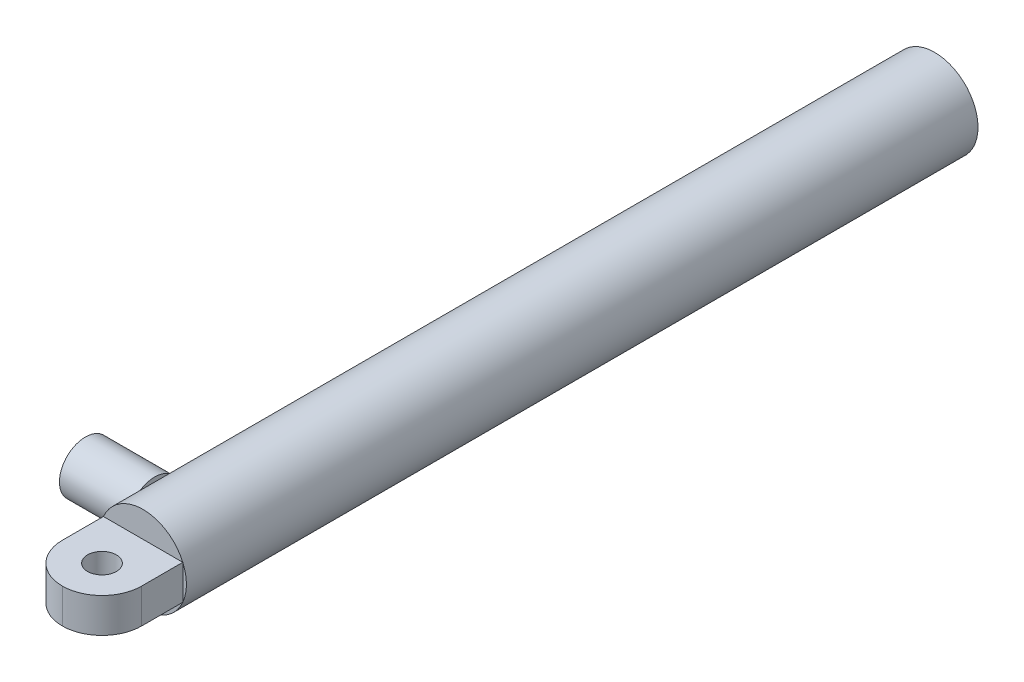
ISO-10303-21;
HEADER;
FILE_DESCRIPTION(('STEP AP214'),'2;1');
FILE_NAME('part.step','',(''),(''),'','','');
FILE_SCHEMA(('AUTOMOTIVE_DESIGN { 1 0 10303 214 1 1 1 1 }'));
ENDSEC;
DATA;
#1=APPLICATION_CONTEXT('core data for automotive mechanical design processes');
#2=APPLICATION_PROTOCOL_DEFINITION('international standard','automotive_design',2000,#1);
#3=PRODUCT_CONTEXT('',#1,'mechanical');
#4=PRODUCT('Part','Part','',(#3));
#5=PRODUCT_RELATED_PRODUCT_CATEGORY('part','',(#4));
#6=PRODUCT_DEFINITION_FORMATION('','',#4);
#7=PRODUCT_DEFINITION_CONTEXT('part definition',#1,'design');
#8=PRODUCT_DEFINITION('design','',#6,#7);
#9=PRODUCT_DEFINITION_SHAPE('','',#8);
#10=(LENGTH_UNIT() NAMED_UNIT(*) SI_UNIT(.MILLI.,.METRE.));
#11=(NAMED_UNIT(*) PLANE_ANGLE_UNIT() SI_UNIT($,.RADIAN.));
#12=(NAMED_UNIT(*) SI_UNIT($,.STERADIAN.) SOLID_ANGLE_UNIT());
#13=UNCERTAINTY_MEASURE_WITH_UNIT(LENGTH_MEASURE(1.E-05),#10,'distance_accuracy_value','');
#14=(GEOMETRIC_REPRESENTATION_CONTEXT(3) GLOBAL_UNCERTAINTY_ASSIGNED_CONTEXT((#13)) GLOBAL_UNIT_ASSIGNED_CONTEXT((#10,
#11,#12)) REPRESENTATION_CONTEXT('',''));
#15=CARTESIAN_POINT('',(0.,0.,0.));
#16=DIRECTION('',(0.,0.,1.));
#17=DIRECTION('',(1.,0.,0.));
#18=AXIS2_PLACEMENT_3D('',#15,#16,#17);
#19=CARTESIAN_POINT('',(0.,0.,664.));
#20=DIRECTION('',(0.,0.,-1.));
#21=DIRECTION('',(-1.,0.,0.));
#22=AXIS2_PLACEMENT_3D('',#19,#20,#21);
#23=CYLINDRICAL_SURFACE('',#22,37.5);
#24=CARTESIAN_POINT('',(0.,0.,686.));
#25=DIRECTION('',(0.,0.,1.));
#26=DIRECTION('',(1.,0.,0.));
#27=AXIS2_PLACEMENT_3D('',#24,#25,#26);
#28=CIRCLE('',#27,37.5);
#29=CARTESIAN_POINT('',(-34.3693177121688,-15.,686.));
#30=VERTEX_POINT('',#29);
#31=CARTESIAN_POINT('',(34.3693177121688,-15.,686.));
#32=VERTEX_POINT('',#31);
#33=EDGE_CURVE('E145',#30,#32,#28,.T.);
#34=ORIENTED_EDGE('',*,*,#33,.F.);
#35=CARTESIAN_POINT('',(-34.3693177121688,15.,686.));
#36=VERTEX_POINT('',#35);
#37=EDGE_CURVE('E144',#36,#30,#28,.T.);
#38=ORIENTED_EDGE('',*,*,#37,.F.);
#39=CARTESIAN_POINT('',(34.3693177121688,15.,686.));
#40=VERTEX_POINT('',#39);
#41=EDGE_CURVE('E269',#40,#36,#28,.T.);
#42=ORIENTED_EDGE('',*,*,#41,.F.);
#43=EDGE_CURVE('E149',#32,#40,#28,.T.);
#44=ORIENTED_EDGE('',*,*,#43,.F.);
#45=EDGE_LOOP('',(#34,#38,#42,#44));
#46=FACE_BOUND('',#45,.T.);
#47=CARTESIAN_POINT('',(0.,0.,0.));
#48=DIRECTION('',(0.,0.,1.));
#49=DIRECTION('',(1.,0.,0.));
#50=AXIS2_PLACEMENT_3D('',#47,#48,#49);
#51=CIRCLE('',#50,37.5);
#52=CARTESIAN_POINT('',(37.5,0.,0.));
#53=VERTEX_POINT('',#52);
#54=EDGE_CURVE('E155',#53,#53,#51,.T.);
#55=ORIENTED_EDGE('',*,*,#54,.T.);
#56=EDGE_LOOP('',(#55));
#57=FACE_BOUND('',#56,.T.);
#58=DIRECTION('',(0.,0.,-1.));
#59=VECTOR('',#58,1.);
#60=CARTESIAN_POINT('',(-34.3693177121688,15.,664.));
#61=LINE('',#60,#59);
#62=CARTESIAN_POINT('',(-34.3693177121688,15.,658.410509831249));
#63=VERTEX_POINT('',#62);
#64=CARTESIAN_POINT('',(-34.3693177121688,15.,624.869490168752));
#65=VERTEX_POINT('',#64);
#66=EDGE_CURVE('E11',#63,#65,#61,.T.);
#67=ORIENTED_EDGE('',*,*,#66,.F.);
#68=CARTESIAN_POINT('',(-34.3693177121688,-15.,658.410509831249));
#69=CARTESIAN_POINT('',(-34.5628287516957,-14.5567209000954,658.806987511772));
#70=CARTESIAN_POINT('',(-34.753259124379,-14.0968897878321,659.186638319474));
#71=CARTESIAN_POINT('',(-35.1240963346518,-13.1456356652409,659.910184644091));
#72=CARTESIAN_POINT('',(-35.3044968691848,-12.6541931985463,660.254057792895));
#73=CARTESIAN_POINT('',(-35.6520956851179,-11.6390565503224,660.905198090059));
#74=CARTESIAN_POINT('',(-35.8192175962027,-11.1152028643747,661.212258023929));
#75=CARTESIAN_POINT('',(-36.1352949412633,-10.0401304004241,661.784890344045));
#76=CARTESIAN_POINT('',(-36.2842536964657,-9.48891665136525,662.050470317617));
#77=CARTESIAN_POINT('',(-36.5610162796752,-8.35951880238463,662.538528200853));
#78=CARTESIAN_POINT('',(-36.6887242850449,-7.78122684512794,662.760811608805));
#79=CARTESIAN_POINT('',(-36.9188537072728,-6.60364236172032,663.158085397292));
#80=CARTESIAN_POINT('',(-37.0212737634304,-6.004348707485,663.333073232983));
#81=CARTESIAN_POINT('',(-37.1977328325532,-4.79097726725823,663.632862034061));
#82=CARTESIAN_POINT('',(-37.2718484197819,-4.17694421585507,663.757798453));
#83=CARTESIAN_POINT('',(-37.3899269709226,-2.93777964019403,663.956205468356));
#84=CARTESIAN_POINT('',(-37.4338935988896,-2.3126494740643,664.029682318764));
#85=CARTESIAN_POINT('',(-37.4877111085339,-1.11614197554258,664.119537371973));
#86=CARTESIAN_POINT('',(-37.5003823623163,-0.545240418529896,664.14063692345));
#87=CARTESIAN_POINT('',(-37.4996001361523,0.5964774996861,664.139333907304));
#88=CARTESIAN_POINT('',(-37.4861482499842,1.16729386396215,664.116933993594));
#89=CARTESIAN_POINT('',(-37.4334488595239,2.30458877960859,664.028933110377));
#90=CARTESIAN_POINT('',(-37.3941914555128,2.87106558179513,663.963315561356));
#91=CARTESIAN_POINT('',(-37.290845191301,3.99517801020673,663.789762800002));
#92=CARTESIAN_POINT('',(-37.2267565774985,4.55281372410406,663.681828007579));
#93=CARTESIAN_POINT('',(-37.078549707373,5.63158725953805,663.430563717142));
#94=CARTESIAN_POINT('',(-36.9954114593022,6.15326331708579,663.288956171824));
#95=CARTESIAN_POINT('',(-36.8095586020448,7.18189300910043,662.969801438841));
#96=CARTESIAN_POINT('',(-36.7068439901398,7.68884664152293,662.792254246186));
#97=CARTESIAN_POINT('',(-36.4838288090728,8.68568893152007,662.402833548178));
#98=CARTESIAN_POINT('',(-36.3635195473292,9.17556900495527,662.190943069999));
#99=CARTESIAN_POINT('',(-36.1076806513707,10.13570080616,661.734780668778));
#100=CARTESIAN_POINT('',(-35.9721525172412,10.6059544621988,661.490511936751));
#101=CARTESIAN_POINT('',(-35.6105717431086,11.7766767549847,660.829221146969));
#102=CARTESIAN_POINT('',(-35.3755323812738,12.4624725279757,660.390755977586));
#103=CARTESIAN_POINT('',(-35.0076626368683,13.4475411338123,659.683743444026));
#104=CARTESIAN_POINT('',(-34.8826793662466,13.7681941230643,659.440241082942));
#105=CARTESIAN_POINT('',(-34.6287075029952,14.3950282693196,658.937236098358));
#106=CARTESIAN_POINT('',(-34.4997190122279,14.7012097938685,658.677733881606));
#107=CARTESIAN_POINT('',(-34.3693177121688,15.,658.410509831249));
#108=B_SPLINE_CURVE_WITH_KNOTS('',3,(#68,#69,#70,#71,#72,#73,#74,#75,#76,#77,#78,#79,#80,#81,
#82,#83,#84,#85,#86,#87,#88,#89,#90,#91,#92,#93,#94,#95,#96,#97,#98,#99,#100,#101,#102,#103,
#104,#105,#106,#107),.UNSPECIFIED.,.F.,.F.,(4,2,2,2,2,2,2,2,2,2,2,2,2,2,2,2,2,2,2,4),(0.,
1.87594742089729,3.75306071997183,5.64028783731769,7.52716934631218,9.42234113275378,
11.3176148728852,13.2077242336482,15.0976038454355,16.8096899193566,18.5216715418299,
20.2343103119635,21.9469320881554,23.5858954528663,25.2248590451667,26.8646351149657,
28.5042496978762,31.0401351017163,32.3044261667614,33.568685104123),.UNSPECIFIED.);
#109=CARTESIAN_POINT('',(-34.3693177121688,-15.,658.410509831249));
#110=VERTEX_POINT('',#109);
#111=EDGE_CURVE('E46',#110,#63,#108,.T.);
#112=ORIENTED_EDGE('',*,*,#111,.F.);
#113=DIRECTION('',(0.,0.,-1.));
#114=VECTOR('',#113,1.);
#115=CARTESIAN_POINT('',(-34.3693177121688,-15.,664.));
#116=LINE('',#115,#114);
#117=CARTESIAN_POINT('',(-34.3693177121688,-15.,624.869490168752));
#118=VERTEX_POINT('',#117);
#119=EDGE_CURVE('E97',#118,#110,#116,.F.);
#120=ORIENTED_EDGE('',*,*,#119,.F.);
#121=CARTESIAN_POINT('',(-34.3693177121688,15.,624.869490168752));
#122=CARTESIAN_POINT('',(-34.5628287516957,14.5567209000954,624.473012488228));
#123=CARTESIAN_POINT('',(-34.753259124379,14.0968897878321,624.093361680526));
#124=CARTESIAN_POINT('',(-35.1240963346518,13.1456356652409,623.369815355909));
#125=CARTESIAN_POINT('',(-35.3044968691848,12.6541931985463,623.025942207105));
#126=CARTESIAN_POINT('',(-35.6520956851179,11.6390565503224,622.374801909941));
#127=CARTESIAN_POINT('',(-35.8192175962027,11.1152028643747,622.067741976071));
#128=CARTESIAN_POINT('',(-36.1352949412633,10.0401304004241,621.495109655955));
#129=CARTESIAN_POINT('',(-36.2842536964657,9.48891665136525,621.229529682383));
#130=CARTESIAN_POINT('',(-36.5610162796752,8.35951880238463,620.741471799147));
#131=CARTESIAN_POINT('',(-36.6887242850449,7.78122684512794,620.519188391195));
#132=CARTESIAN_POINT('',(-36.9188537072728,6.60364236172032,620.121914602708));
#133=CARTESIAN_POINT('',(-37.0212737634304,6.004348707485,619.946926767017));
#134=CARTESIAN_POINT('',(-37.1977328325532,4.79097726725823,619.647137965939));
#135=CARTESIAN_POINT('',(-37.2718484197819,4.17694421585507,619.522201547));
#136=CARTESIAN_POINT('',(-37.3899269709226,2.93777964019403,619.323794531645));
#137=CARTESIAN_POINT('',(-37.4338935988896,2.3126494740643,619.250317681236));
#138=CARTESIAN_POINT('',(-37.4877111085339,1.11614197554259,619.160462628027));
#139=CARTESIAN_POINT('',(-37.5003823623163,0.5452404185299,619.13936307655));
#140=CARTESIAN_POINT('',(-37.4996001361523,-0.596477499686092,619.140666092696));
#141=CARTESIAN_POINT('',(-37.4861482499842,-1.16729386396215,619.163066006406));
#142=CARTESIAN_POINT('',(-37.4334488595239,-2.30458877960858,619.251066889624));
#143=CARTESIAN_POINT('',(-37.3941914555128,-2.87106558179512,619.316684438644));
#144=CARTESIAN_POINT('',(-37.2908451913011,-3.99517801020673,619.490237199998));
#145=CARTESIAN_POINT('',(-37.2267565774985,-4.55281372410406,619.598171992421));
#146=CARTESIAN_POINT('',(-37.078549707373,-5.63158725953805,619.849436282858));
#147=CARTESIAN_POINT('',(-36.9954114593022,-6.15326331708579,619.991043828176));
#148=CARTESIAN_POINT('',(-36.8095586020448,-7.18189300910043,620.310198561159));
#149=CARTESIAN_POINT('',(-36.7068439901398,-7.68884664152293,620.487745753814));
#150=CARTESIAN_POINT('',(-36.4838288090728,-8.68568893152007,620.877166451822));
#151=CARTESIAN_POINT('',(-36.3635195473291,-9.17556900495527,621.089056930001));
#152=CARTESIAN_POINT('',(-36.1076806513707,-10.13570080616,621.545219331222));
#153=CARTESIAN_POINT('',(-35.9721525172412,-10.6059544621988,621.789488063249));
#154=CARTESIAN_POINT('',(-35.6105717431086,-11.7766767549847,622.450778853032));
#155=CARTESIAN_POINT('',(-35.3755323812738,-12.4624725279757,622.889244022414));
#156=CARTESIAN_POINT('',(-35.0076626368683,-13.4475411338123,623.596256555975));
#157=CARTESIAN_POINT('',(-34.8826793662466,-13.7681941230643,623.839758917058));
#158=CARTESIAN_POINT('',(-34.6287075029952,-14.3950282693196,624.342763901643));
#159=CARTESIAN_POINT('',(-34.4997190122279,-14.7012097938685,624.602266118394));
#160=CARTESIAN_POINT('',(-34.3693177121688,-15.,624.869490168752));
#161=B_SPLINE_CURVE_WITH_KNOTS('',3,(#121,#122,#123,#124,#125,#126,#127,#128,#129,#130,#131,
#132,#133,#134,#135,#136,#137,#138,#139,#140,#141,#142,#143,#144,#145,#146,#147,#148,#149,#150,
#151,#152,#153,#154,#155,#156,#157,#158,#159,#160),.UNSPECIFIED.,.F.,.F.,(4,2,2,2,2,2,2,2,2,2,2,
2,2,2,2,2,2,2,2,4),(0.,1.87594742089729,3.75306071997183,5.64028783731769,7.52716934631218,
9.42234113275378,11.3176148728852,13.2077242336482,15.0976038454355,16.8096899193566,
18.5216715418299,20.2343103119635,21.9469320881554,23.5858954528663,25.2248590451667,
26.8646351149657,28.5042496978762,31.0401351017163,32.3044261667614,33.568685104123),.UNSPECIFIED.);
#162=EDGE_CURVE('E56',#65,#118,#161,.T.);
#163=ORIENTED_EDGE('',*,*,#162,.F.);
#164=EDGE_LOOP('',(#67,#112,#120,#163));
#165=FACE_BOUND('',#164,.T.);
#166=ADVANCED_FACE('F38',(#46,#57,#165),#23,.T.);
#167=CARTESIAN_POINT('',(0.,0.,686.));
#168=DIRECTION('',(0.,0.,1.));
#169=DIRECTION('',(1.,0.,0.));
#170=AXIS2_PLACEMENT_3D('',#167,#168,#169);
#171=PLANE('',#170);
#172=DIRECTION('',(0.,-1.,0.));
#173=VECTOR('',#172,1.);
#174=CARTESIAN_POINT('',(-34.3693177121688,-15.,686.));
#175=LINE('',#174,#173);
#176=EDGE_CURVE('E128',#36,#30,#175,.T.);
#177=ORIENTED_EDGE('',*,*,#176,.F.);
#178=ORIENTED_EDGE('',*,*,#37,.T.);
#179=EDGE_LOOP('',(#177,#178));
#180=FACE_BOUND('',#179,.T.);
#181=ADVANCED_FACE('F227',(#180),#171,.T.);
#182=ORIENTED_EDGE('',*,*,#43,.T.);
#183=DIRECTION('',(0.,1.,0.));
#184=VECTOR('',#183,1.);
#185=CARTESIAN_POINT('',(34.3693177121688,-15.,686.));
#186=LINE('',#185,#184);
#187=EDGE_CURVE('E133',#32,#40,#186,.T.);
#188=ORIENTED_EDGE('',*,*,#187,.F.);
#189=EDGE_LOOP('',(#182,#188));
#190=FACE_BOUND('',#189,.T.);
#191=ADVANCED_FACE('F241',(#190),#171,.T.);
#192=DIRECTION('',(1.,0.,0.));
#193=VECTOR('',#192,1.);
#194=CARTESIAN_POINT('',(-34.3693177121688,15.,686.));
#195=LINE('',#194,#193);
#196=EDGE_CURVE('E117',#36,#40,#195,.T.);
#197=ORIENTED_EDGE('',*,*,#196,.T.);
#198=ORIENTED_EDGE('',*,*,#41,.T.);
#199=EDGE_LOOP('',(#197,#198));
#200=FACE_BOUND('',#199,.T.);
#201=ADVANCED_FACE('F228',(#200),#171,.T.);
#202=CARTESIAN_POINT('',(0.,0.,0.));
#203=DIRECTION('',(0.,0.,1.));
#204=DIRECTION('',(1.,0.,0.));
#205=AXIS2_PLACEMENT_3D('',#202,#203,#204);
#206=PLANE('',#205);
#207=ORIENTED_EDGE('',*,*,#54,.F.);
#208=EDGE_LOOP('',(#207));
#209=FACE_BOUND('',#208,.T.);
#210=CARTESIAN_POINT('',(0.,0.,0.));
#211=DIRECTION('',(0.,0.,1.));
#212=DIRECTION('',(1.,0.,0.));
#213=AXIS2_PLACEMENT_3D('',#210,#211,#212);
#214=CIRCLE('',#213,17.5);
#215=CARTESIAN_POINT('',(17.5,0.,0.));
#216=VERTEX_POINT('',#215);
#217=EDGE_CURVE('E152',#216,#216,#214,.T.);
#218=ORIENTED_EDGE('',*,*,#217,.T.);
#219=EDGE_LOOP('',(#218));
#220=FACE_BOUND('',#219,.T.);
#221=ADVANCED_FACE('F234',(#209,#220),#206,.F.);
#222=CARTESIAN_POINT('',(0.,0.,664.));
#223=DIRECTION('',(0.,0.,-1.));
#224=DIRECTION('',(-1.,0.,0.));
#225=AXIS2_PLACEMENT_3D('',#222,#223,#224);
#226=CYLINDRICAL_SURFACE('',#225,17.5);
#227=CARTESIAN_POINT('',(0.,0.,664.));
#228=DIRECTION('',(0.,0.,1.));
#229=DIRECTION('',(1.,0.,0.));
#230=AXIS2_PLACEMENT_3D('',#227,#228,#229);
#231=CIRCLE('',#230,17.5);
#232=CARTESIAN_POINT('',(17.5,0.,664.));
#233=VERTEX_POINT('',#232);
#234=EDGE_CURVE('E148',#233,#233,#231,.T.);
#235=ORIENTED_EDGE('',*,*,#234,.T.);
#236=EDGE_LOOP('',(#235));
#237=FACE_BOUND('',#236,.T.);
#238=ORIENTED_EDGE('',*,*,#217,.F.);
#239=EDGE_LOOP('',(#238));
#240=FACE_BOUND('',#239,.T.);
#241=ADVANCED_FACE('F231',(#237,#240),#226,.F.);
#242=CARTESIAN_POINT('',(0.,0.,664.));
#243=DIRECTION('',(0.,0.,1.));
#244=DIRECTION('',(1.,0.,0.));
#245=AXIS2_PLACEMENT_3D('',#242,#243,#244);
#246=PLANE('',#245);
#247=ORIENTED_EDGE('',*,*,#234,.F.);
#248=EDGE_LOOP('',(#247));
#249=FACE_BOUND('',#248,.T.);
#250=ADVANCED_FACE('F225',(#249),#246,.F.);
#251=DIRECTION('',(1.,0.,0.));
#252=VECTOR('',#251,1.);
#253=CARTESIAN_POINT('',(-34.3693177121688,-15.,686.));
#254=LINE('',#253,#252);
#255=EDGE_CURVE('E136',#30,#32,#254,.T.);
#256=ORIENTED_EDGE('',*,*,#255,.F.);
#257=ORIENTED_EDGE('',*,*,#33,.T.);
#258=EDGE_LOOP('',(#256,#257));
#259=FACE_BOUND('',#258,.T.);
#260=ADVANCED_FACE('F221',(#259),#171,.T.);
#261=CARTESIAN_POINT('',(-34.3693177121688,-15.,756.));
#262=DIRECTION('',(1.,0.,0.));
#263=DIRECTION('',(0.,0.,-1.));
#264=AXIS2_PLACEMENT_3D('',#261,#262,#263);
#265=PLANE('',#264);
#266=DIRECTION('',(0.,0.,-1.));
#267=VECTOR('',#266,1.);
#268=CARTESIAN_POINT('',(-34.3693177121688,-15.,756.));
#269=LINE('',#268,#267);
#270=CARTESIAN_POINT('',(-34.3693177121688,-15.,721.64));
#271=VERTEX_POINT('',#270);
#272=EDGE_CURVE('E142',#271,#30,#269,.T.);
#273=ORIENTED_EDGE('',*,*,#272,.F.);
#274=DIRECTION('',(0.,-1.,0.));
#275=VECTOR('',#274,1.);
#276=CARTESIAN_POINT('',(-34.3693177121688,-15.,721.64));
#277=LINE('',#276,#275);
#278=CARTESIAN_POINT('',(-34.3693177121688,15.,721.64));
#279=VERTEX_POINT('',#278);
#280=EDGE_CURVE('E106',#271,#279,#277,.F.);
#281=ORIENTED_EDGE('',*,*,#280,.T.);
#282=DIRECTION('',(0.,0.,-1.));
#283=VECTOR('',#282,1.);
#284=CARTESIAN_POINT('',(-34.3693177121688,15.,756.));
#285=LINE('',#284,#283);
#286=EDGE_CURVE('E122',#279,#36,#285,.T.);
#287=ORIENTED_EDGE('',*,*,#286,.T.);
#288=ORIENTED_EDGE('',*,*,#176,.T.);
#289=EDGE_LOOP('',(#273,#281,#287,#288));
#290=FACE_BOUND('',#289,.T.);
#291=ADVANCED_FACE('F217',(#290),#265,.F.);
#292=CARTESIAN_POINT('',(-34.3693177121688,-15.,756.));
#293=DIRECTION('',(0.,1.,0.));
#294=DIRECTION('',(0.,0.,1.));
#295=AXIS2_PLACEMENT_3D('',#292,#293,#294);
#296=PLANE('',#295);
#297=CARTESIAN_POINT('',(0.,-15.,721.64));
#298=DIRECTION('',(0.,1.,0.));
#299=DIRECTION('',(0.,0.,1.));
#300=AXIS2_PLACEMENT_3D('',#297,#298,#299);
#301=CIRCLE('',#300,12.5);
#302=CARTESIAN_POINT('',(0.,-15.,734.14));
#303=VERTEX_POINT('',#302);
#304=EDGE_CURVE('E114',#303,#303,#301,.T.);
#305=ORIENTED_EDGE('',*,*,#304,.T.);
#306=EDGE_LOOP('',(#305));
#307=FACE_BOUND('',#306,.T.);
#308=DIRECTION('',(0.,0.,-1.));
#309=VECTOR('',#308,1.);
#310=CARTESIAN_POINT('',(34.3693177121688,-15.,756.));
#311=LINE('',#310,#309);
#312=CARTESIAN_POINT('',(34.3693177121688,-15.,721.64));
#313=VERTEX_POINT('',#312);
#314=EDGE_CURVE('E132',#313,#32,#311,.T.);
#315=ORIENTED_EDGE('',*,*,#314,.F.);
#316=CARTESIAN_POINT('',(0.00931771216881871,-15.,721.64));
#317=DIRECTION('',(0.,1.,0.));
#318=DIRECTION('',(0.,0.,1.));
#319=AXIS2_PLACEMENT_3D('',#316,#317,#318);
#320=CIRCLE('',#319,34.36);
#321=CARTESIAN_POINT('',(0.00931771216881871,-15.,756.));
#322=VERTEX_POINT('',#321);
#323=EDGE_CURVE('E172',#313,#322,#320,.F.);
#324=ORIENTED_EDGE('',*,*,#323,.T.);
#325=DIRECTION('',(1.,0.,0.));
#326=VECTOR('',#325,1.);
#327=CARTESIAN_POINT('',(-34.3693177121688,-15.,756.));
#328=LINE('',#327,#326);
#329=CARTESIAN_POINT('',(-0.00931771216881871,-15.,756.));
#330=VERTEX_POINT('',#329);
#331=EDGE_CURVE('E129',#330,#322,#328,.T.);
#332=ORIENTED_EDGE('',*,*,#331,.F.);
#333=CARTESIAN_POINT('',(-0.00931771216881871,-15.,721.64));
#334=DIRECTION('',(0.,1.,0.));
#335=DIRECTION('',(0.,0.,1.));
#336=AXIS2_PLACEMENT_3D('',#333,#334,#335);
#337=CIRCLE('',#336,34.36);
#338=EDGE_CURVE('E170',#330,#271,#337,.F.);
#339=ORIENTED_EDGE('',*,*,#338,.T.);
#340=ORIENTED_EDGE('',*,*,#272,.T.);
#341=ORIENTED_EDGE('',*,*,#255,.T.);
#342=EDGE_LOOP('',(#315,#324,#332,#339,#340,#341));
#343=FACE_BOUND('',#342,.T.);
#344=ADVANCED_FACE('F213',(#307,#343),#296,.F.);
#345=CARTESIAN_POINT('',(34.3693177121688,-15.,756.));
#346=DIRECTION('',(-1.,0.,0.));
#347=DIRECTION('',(0.,0.,1.));
#348=AXIS2_PLACEMENT_3D('',#345,#346,#347);
#349=PLANE('',#348);
#350=DIRECTION('',(0.,0.,-1.));
#351=VECTOR('',#350,1.);
#352=CARTESIAN_POINT('',(34.3693177121688,15.,756.));
#353=LINE('',#352,#351);
#354=CARTESIAN_POINT('',(34.3693177121688,15.,721.64));
#355=VERTEX_POINT('',#354);
#356=EDGE_CURVE('E126',#355,#40,#353,.T.);
#357=ORIENTED_EDGE('',*,*,#356,.F.);
#358=DIRECTION('',(0.,1.,0.));
#359=VECTOR('',#358,1.);
#360=CARTESIAN_POINT('',(34.3693177121688,-15.,721.64));
#361=LINE('',#360,#359);
#362=EDGE_CURVE('E168',#355,#313,#361,.F.);
#363=ORIENTED_EDGE('',*,*,#362,.T.);
#364=ORIENTED_EDGE('',*,*,#314,.T.);
#365=ORIENTED_EDGE('',*,*,#187,.T.);
#366=EDGE_LOOP('',(#357,#363,#364,#365));
#367=FACE_BOUND('',#366,.T.);
#368=ADVANCED_FACE('F209',(#367),#349,.F.);
#369=CARTESIAN_POINT('',(0.,0.,756.));
#370=DIRECTION('',(0.,0.,-1.));
#371=DIRECTION('',(-1.,0.,0.));
#372=AXIS2_PLACEMENT_3D('',#369,#370,#371);
#373=PLANE('',#372);
#374=ORIENTED_EDGE('',*,*,#331,.T.);
#375=DIRECTION('',(0.,1.,0.));
#376=VECTOR('',#375,1.);
#377=CARTESIAN_POINT('',(0.00931771216881871,0.,756.));
#378=LINE('',#377,#376);
#379=CARTESIAN_POINT('',(0.00931771216881871,15.,756.));
#380=VERTEX_POINT('',#379);
#381=EDGE_CURVE('E161',#322,#380,#378,.T.);
#382=ORIENTED_EDGE('',*,*,#381,.T.);
#383=DIRECTION('',(1.,0.,0.));
#384=VECTOR('',#383,1.);
#385=CARTESIAN_POINT('',(-34.3693177121688,15.,756.));
#386=LINE('',#385,#384);
#387=CARTESIAN_POINT('',(-0.00931771216881871,15.,756.));
#388=VERTEX_POINT('',#387);
#389=EDGE_CURVE('E119',#388,#380,#386,.T.);
#390=ORIENTED_EDGE('',*,*,#389,.F.);
#391=DIRECTION('',(0.,-1.,0.));
#392=VECTOR('',#391,1.);
#393=CARTESIAN_POINT('',(-0.00931771216881871,0.,756.));
#394=LINE('',#393,#392);
#395=EDGE_CURVE('E158',#388,#330,#394,.T.);
#396=ORIENTED_EDGE('',*,*,#395,.T.);
#397=EDGE_LOOP('',(#374,#382,#390,#396));
#398=FACE_BOUND('',#397,.T.);
#399=ADVANCED_FACE('F205',(#398),#373,.F.);
#400=CARTESIAN_POINT('',(-34.3693177121688,15.,756.));
#401=DIRECTION('',(0.,1.,0.));
#402=DIRECTION('',(0.,0.,1.));
#403=AXIS2_PLACEMENT_3D('',#400,#401,#402);
#404=PLANE('',#403);
#405=CARTESIAN_POINT('',(0.,15.,721.64));
#406=DIRECTION('',(0.,1.,0.));
#407=DIRECTION('',(0.,0.,1.));
#408=AXIS2_PLACEMENT_3D('',#405,#406,#407);
#409=CIRCLE('',#408,12.5);
#410=CARTESIAN_POINT('',(0.,15.,734.14));
#411=VERTEX_POINT('',#410);
#412=EDGE_CURVE('E118',#411,#411,#409,.T.);
#413=ORIENTED_EDGE('',*,*,#412,.F.);
#414=EDGE_LOOP('',(#413));
#415=FACE_BOUND('',#414,.T.);
#416=ORIENTED_EDGE('',*,*,#389,.T.);
#417=CARTESIAN_POINT('',(0.00931771216881871,15.,721.64));
#418=DIRECTION('',(0.,1.,0.));
#419=DIRECTION('',(0.,0.,1.));
#420=AXIS2_PLACEMENT_3D('',#417,#418,#419);
#421=CIRCLE('',#420,34.36);
#422=EDGE_CURVE('E166',#380,#355,#421,.T.);
#423=ORIENTED_EDGE('',*,*,#422,.T.);
#424=ORIENTED_EDGE('',*,*,#356,.T.);
#425=ORIENTED_EDGE('',*,*,#196,.F.);
#426=ORIENTED_EDGE('',*,*,#286,.F.);
#427=CARTESIAN_POINT('',(-0.00931771216881871,15.,721.64));
#428=DIRECTION('',(0.,1.,0.));
#429=DIRECTION('',(0.,0.,1.));
#430=AXIS2_PLACEMENT_3D('',#427,#428,#429);
#431=CIRCLE('',#430,34.36);
#432=EDGE_CURVE('E164',#279,#388,#431,.T.);
#433=ORIENTED_EDGE('',*,*,#432,.T.);
#434=EDGE_LOOP('',(#416,#423,#424,#425,#426,#433));
#435=FACE_BOUND('',#434,.T.);
#436=ADVANCED_FACE('F201',(#415,#435),#404,.T.);
#437=CARTESIAN_POINT('',(0.00931771216881871,0.,721.64));
#438=DIRECTION('',(0.,1.,0.));
#439=DIRECTION('',(0.,0.,1.));
#440=AXIS2_PLACEMENT_3D('',#437,#438,#439);
#441=CYLINDRICAL_SURFACE('',#440,34.36);
#442=ORIENTED_EDGE('',*,*,#323,.F.);
#443=ORIENTED_EDGE('',*,*,#362,.F.);
#444=ORIENTED_EDGE('',*,*,#422,.F.);
#445=ORIENTED_EDGE('',*,*,#381,.F.);
#446=EDGE_LOOP('',(#442,#443,#444,#445));
#447=FACE_BOUND('',#446,.T.);
#448=ADVANCED_FACE('F204',(#447),#441,.T.);
#449=CARTESIAN_POINT('',(-0.00931771216881871,0.,721.64));
#450=DIRECTION('',(0.,-1.,0.));
#451=DIRECTION('',(0.,0.,-1.));
#452=AXIS2_PLACEMENT_3D('',#449,#450,#451);
#453=CYLINDRICAL_SURFACE('',#452,34.36);
#454=ORIENTED_EDGE('',*,*,#432,.F.);
#455=ORIENTED_EDGE('',*,*,#280,.F.);
#456=ORIENTED_EDGE('',*,*,#338,.F.);
#457=ORIENTED_EDGE('',*,*,#395,.F.);
#458=EDGE_LOOP('',(#454,#455,#456,#457));
#459=FACE_BOUND('',#458,.T.);
#460=ADVANCED_FACE('F40',(#459),#453,.T.);
#461=CARTESIAN_POINT('',(0.,-85.,721.64));
#462=DIRECTION('',(0.,1.,0.));
#463=DIRECTION('',(0.,0.,1.));
#464=AXIS2_PLACEMENT_3D('',#461,#462,#463);
#465=CYLINDRICAL_SURFACE('',#464,12.5);
#466=ORIENTED_EDGE('',*,*,#412,.T.);
#467=EDGE_LOOP('',(#466));
#468=FACE_BOUND('',#467,.T.);
#469=ORIENTED_EDGE('',*,*,#304,.F.);
#470=EDGE_LOOP('',(#469));
#471=FACE_BOUND('',#470,.T.);
#472=ADVANCED_FACE('F194',(#468,#471),#465,.F.);
#473=CARTESIAN_POINT('',(-94.3693177121688,0.,641.64));
#474=DIRECTION('',(1.,0.,0.));
#475=DIRECTION('',(0.,0.,-1.));
#476=AXIS2_PLACEMENT_3D('',#473,#474,#475);
#477=CYLINDRICAL_SURFACE('',#476,22.5);
#478=CARTESIAN_POINT('',(-94.3693177121688,0.,641.64));
#479=DIRECTION('',(-1.,0.,0.));
#480=DIRECTION('',(0.,0.,1.));
#481=AXIS2_PLACEMENT_3D('',#478,#479,#480);
#482=CIRCLE('',#481,22.5);
#483=CARTESIAN_POINT('',(-94.3693177121688,0.,664.14));
#484=VERTEX_POINT('',#483);
#485=EDGE_CURVE('E111',#484,#484,#482,.T.);
#486=ORIENTED_EDGE('',*,*,#485,.F.);
#487=EDGE_LOOP('',(#486));
#488=FACE_BOUND('',#487,.T.);
#489=CARTESIAN_POINT('',(-34.3693177121688,0.,641.64));
#490=DIRECTION('',(-1.,0.,0.));
#491=DIRECTION('',(0.,0.,1.));
#492=AXIS2_PLACEMENT_3D('',#489,#490,#491);
#493=CIRCLE('',#492,22.5);
#494=EDGE_CURVE('E105',#118,#110,#493,.T.);
#495=ORIENTED_EDGE('',*,*,#494,.T.);
#496=ORIENTED_EDGE('',*,*,#111,.T.);
#497=EDGE_CURVE('E109',#63,#65,#493,.T.);
#498=ORIENTED_EDGE('',*,*,#497,.T.);
#499=ORIENTED_EDGE('',*,*,#162,.T.);
#500=EDGE_LOOP('',(#495,#496,#498,#499));
#501=FACE_BOUND('',#500,.T.);
#502=ADVANCED_FACE('F108',(#488,#501),#477,.T.);
#503=CARTESIAN_POINT('',(-34.3693177121688,0.,641.64));
#504=DIRECTION('',(-1.,0.,0.));
#505=DIRECTION('',(0.,0.,1.));
#506=AXIS2_PLACEMENT_3D('',#503,#504,#505);
#507=PLANE('',#506);
#508=ORIENTED_EDGE('',*,*,#497,.F.);
#509=ORIENTED_EDGE('',*,*,#66,.T.);
#510=EDGE_LOOP('',(#508,#509));
#511=FACE_BOUND('',#510,.T.);
#512=ADVANCED_FACE('F193',(#511),#507,.F.);
#513=ORIENTED_EDGE('',*,*,#494,.F.);
#514=ORIENTED_EDGE('',*,*,#119,.T.);
#515=EDGE_LOOP('',(#513,#514));
#516=FACE_BOUND('',#515,.T.);
#517=ADVANCED_FACE('F104',(#516),#507,.F.);
#518=CARTESIAN_POINT('',(-94.3693177121688,0.,641.64));
#519=DIRECTION('',(-1.,0.,0.));
#520=DIRECTION('',(0.,0.,1.));
#521=AXIS2_PLACEMENT_3D('',#518,#519,#520);
#522=PLANE('',#521);
#523=ORIENTED_EDGE('',*,*,#485,.T.);
#524=EDGE_LOOP('',(#523));
#525=FACE_BOUND('',#524,.T.);
#526=ADVANCED_FACE('F309',(#525),#522,.T.);
#527=CLOSED_SHELL('',(#166,#181,#191,#201,#221,#241,#250,#260,#291,#344,#368,#399,#436,#448,
#460,#472,#502,#512,#517,#526));
#528=MANIFOLD_SOLID_BREP('B2',#527);
#529=ADVANCED_BREP_SHAPE_REPRESENTATION('',(#18,#528),#14);
#530=SHAPE_DEFINITION_REPRESENTATION(#9,#529);
ENDSEC;
END-ISO-10303-21;
